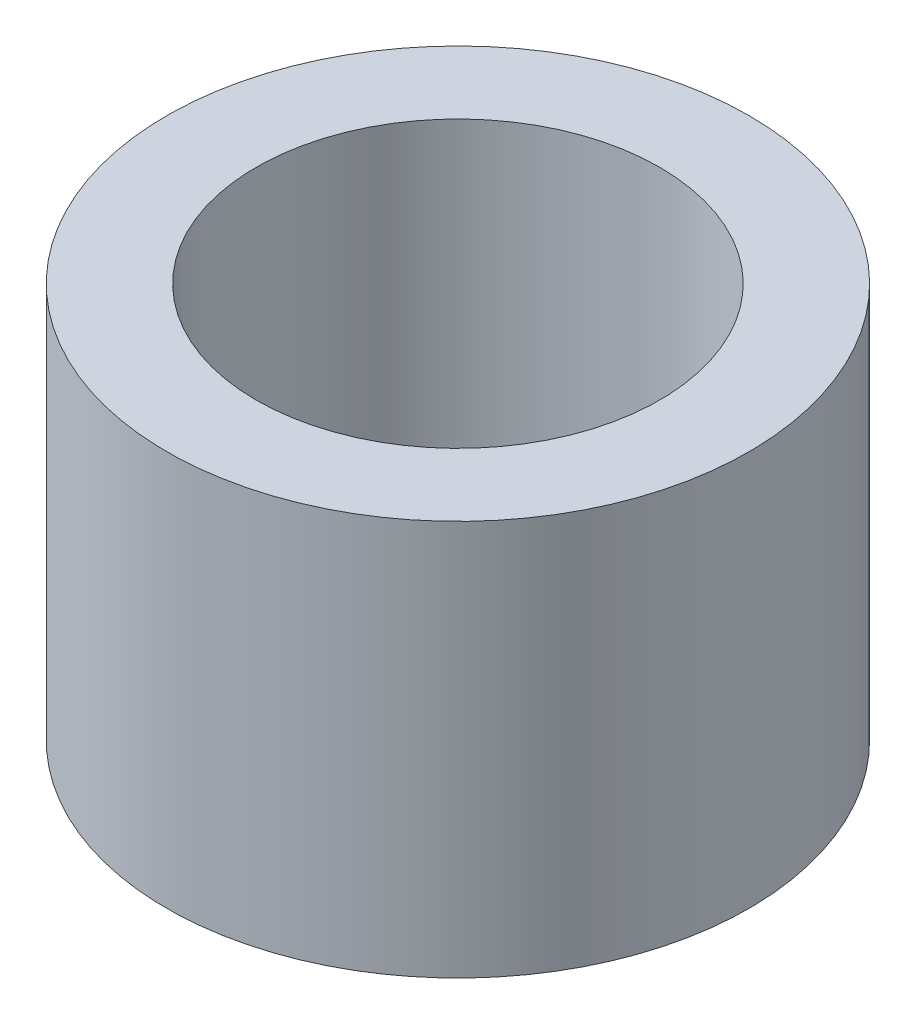
ISO-10303-21;
HEADER;
FILE_DESCRIPTION(('STEP AP214'),'2;1');
FILE_NAME('part.step','',(''),(''),'','','');
FILE_SCHEMA(('AUTOMOTIVE_DESIGN { 1 0 10303 214 1 1 1 1 }'));
ENDSEC;
DATA;
#1=APPLICATION_CONTEXT('core data for automotive mechanical design processes');
#2=APPLICATION_PROTOCOL_DEFINITION('international standard','automotive_design',2000,#1);
#3=PRODUCT_CONTEXT('',#1,'mechanical');
#4=PRODUCT('Part','Part','',(#3));
#5=PRODUCT_RELATED_PRODUCT_CATEGORY('part','',(#4));
#6=PRODUCT_DEFINITION_FORMATION('','',#4);
#7=PRODUCT_DEFINITION_CONTEXT('part definition',#1,'design');
#8=PRODUCT_DEFINITION('design','',#6,#7);
#9=PRODUCT_DEFINITION_SHAPE('','',#8);
#10=(LENGTH_UNIT() NAMED_UNIT(*) SI_UNIT(.MILLI.,.METRE.));
#11=(NAMED_UNIT(*) PLANE_ANGLE_UNIT() SI_UNIT($,.RADIAN.));
#12=(NAMED_UNIT(*) SI_UNIT($,.STERADIAN.) SOLID_ANGLE_UNIT());
#13=UNCERTAINTY_MEASURE_WITH_UNIT(LENGTH_MEASURE(1.E-05),#10,'distance_accuracy_value','');
#14=(GEOMETRIC_REPRESENTATION_CONTEXT(3) GLOBAL_UNCERTAINTY_ASSIGNED_CONTEXT((#13)) GLOBAL_UNIT_ASSIGNED_CONTEXT((#10,
#11,#12)) REPRESENTATION_CONTEXT('',''));
#15=CARTESIAN_POINT('',(0.,0.,0.));
#16=DIRECTION('',(0.,0.,1.));
#17=DIRECTION('',(1.,0.,0.));
#18=AXIS2_PLACEMENT_3D('',#15,#16,#17);
#19=CARTESIAN_POINT('',(0.,0.,0.));
#20=DIRECTION('',(0.,-1.,0.));
#21=DIRECTION('',(0.,0.,-1.));
#22=AXIS2_PLACEMENT_3D('',#19,#20,#21);
#23=CYLINDRICAL_SURFACE('',#22,28.0416);
#24=CARTESIAN_POINT('',(0.,0.,0.));
#25=DIRECTION('',(0.,-1.,0.));
#26=DIRECTION('',(0.,0.,-1.));
#27=AXIS2_PLACEMENT_3D('',#24,#25,#26);
#28=CIRCLE('',#27,28.0416);
#29=CARTESIAN_POINT('',(0.,0.,-28.0416));
#30=VERTEX_POINT('',#29);
#31=EDGE_CURVE('E10',#30,#30,#28,.T.);
#32=ORIENTED_EDGE('',*,*,#31,.F.);
#33=EDGE_LOOP('',(#32));
#34=FACE_BOUND('',#33,.T.);
#35=CARTESIAN_POINT('',(0.,38.1,0.));
#36=DIRECTION('',(0.,-1.,0.));
#37=DIRECTION('',(0.,0.,-1.));
#38=AXIS2_PLACEMENT_3D('',#35,#36,#37);
#39=CIRCLE('',#38,28.0416);
#40=CARTESIAN_POINT('',(0.,38.1,-28.0416));
#41=VERTEX_POINT('',#40);
#42=EDGE_CURVE('E45',#41,#41,#39,.T.);
#43=ORIENTED_EDGE('',*,*,#42,.T.);
#44=EDGE_LOOP('',(#43));
#45=FACE_BOUND('',#44,.T.);
#46=ADVANCED_FACE('F31',(#34,#45),#23,.T.);
#47=CARTESIAN_POINT('',(-28.0416,0.,0.));
#48=DIRECTION('',(0.,1.,0.));
#49=DIRECTION('',(0.,0.,1.));
#50=AXIS2_PLACEMENT_3D('',#47,#48,#49);
#51=PLANE('',#50);
#52=CARTESIAN_POINT('',(0.,0.,0.));
#53=DIRECTION('',(0.,-1.,0.));
#54=DIRECTION('',(0.,0.,-1.));
#55=AXIS2_PLACEMENT_3D('',#52,#53,#54);
#56=CIRCLE('',#55,19.431);
#57=CARTESIAN_POINT('',(0.,0.,-19.431));
#58=VERTEX_POINT('',#57);
#59=EDGE_CURVE('E37',#58,#58,#56,.T.);
#60=ORIENTED_EDGE('',*,*,#59,.F.);
#61=EDGE_LOOP('',(#60));
#62=FACE_BOUND('',#61,.T.);
#63=ORIENTED_EDGE('',*,*,#31,.T.);
#64=EDGE_LOOP('',(#63));
#65=FACE_BOUND('',#64,.T.);
#66=ADVANCED_FACE('F60',(#62,#65),#51,.F.);
#67=CARTESIAN_POINT('',(0.,0.,0.));
#68=DIRECTION('',(0.,-1.,0.));
#69=DIRECTION('',(0.,0.,-1.));
#70=AXIS2_PLACEMENT_3D('',#67,#68,#69);
#71=CYLINDRICAL_SURFACE('',#70,19.431);
#72=CARTESIAN_POINT('',(0.,38.1,0.));
#73=DIRECTION('',(0.,-1.,0.));
#74=DIRECTION('',(0.,0.,-1.));
#75=AXIS2_PLACEMENT_3D('',#72,#73,#74);
#76=CIRCLE('',#75,19.431);
#77=CARTESIAN_POINT('',(0.,38.1,-19.431));
#78=VERTEX_POINT('',#77);
#79=EDGE_CURVE('E41',#78,#78,#76,.T.);
#80=ORIENTED_EDGE('',*,*,#79,.F.);
#81=EDGE_LOOP('',(#80));
#82=FACE_BOUND('',#81,.T.);
#83=ORIENTED_EDGE('',*,*,#59,.T.);
#84=EDGE_LOOP('',(#83));
#85=FACE_BOUND('',#84,.T.);
#86=ADVANCED_FACE('F55',(#82,#85),#71,.F.);
#87=CARTESIAN_POINT('',(-28.0416,38.1,0.));
#88=DIRECTION('',(0.,-1.,0.));
#89=DIRECTION('',(0.,0.,-1.));
#90=AXIS2_PLACEMENT_3D('',#87,#88,#89);
#91=PLANE('',#90);
#92=ORIENTED_EDGE('',*,*,#42,.F.);
#93=EDGE_LOOP('',(#92));
#94=FACE_BOUND('',#93,.T.);
#95=ORIENTED_EDGE('',*,*,#79,.T.);
#96=EDGE_LOOP('',(#95));
#97=FACE_BOUND('',#96,.T.);
#98=ADVANCED_FACE('F52',(#94,#97),#91,.F.);
#99=CLOSED_SHELL('',(#46,#66,#86,#98));
#100=MANIFOLD_SOLID_BREP('B2',#99);
#101=ADVANCED_BREP_SHAPE_REPRESENTATION('',(#18,#100),#14);
#102=SHAPE_DEFINITION_REPRESENTATION(#9,#101);
ENDSEC;
END-ISO-10303-21;
